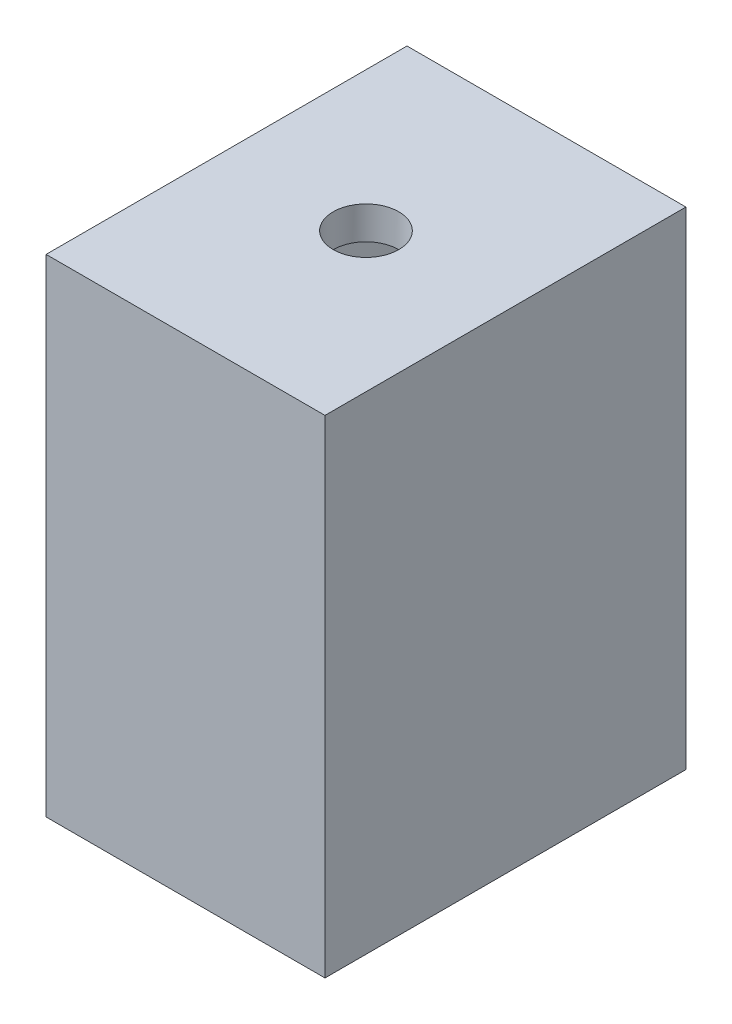
ISO-10303-21;
HEADER;
FILE_DESCRIPTION(('STEP AP214'),'2;1');
FILE_NAME('part.step','',(''),(''),'','','');
FILE_SCHEMA(('AUTOMOTIVE_DESIGN { 1 0 10303 214 1 1 1 1 }'));
ENDSEC;
DATA;
#1=APPLICATION_CONTEXT('core data for automotive mechanical design processes');
#2=APPLICATION_PROTOCOL_DEFINITION('international standard','automotive_design',2000,#1);
#3=PRODUCT_CONTEXT('',#1,'mechanical');
#4=PRODUCT('Part','Part','',(#3));
#5=PRODUCT_RELATED_PRODUCT_CATEGORY('part','',(#4));
#6=PRODUCT_DEFINITION_FORMATION('','',#4);
#7=PRODUCT_DEFINITION_CONTEXT('part definition',#1,'design');
#8=PRODUCT_DEFINITION('design','',#6,#7);
#9=PRODUCT_DEFINITION_SHAPE('','',#8);
#10=(LENGTH_UNIT() NAMED_UNIT(*) SI_UNIT(.MILLI.,.METRE.));
#11=(NAMED_UNIT(*) PLANE_ANGLE_UNIT() SI_UNIT($,.RADIAN.));
#12=(NAMED_UNIT(*) SI_UNIT($,.STERADIAN.) SOLID_ANGLE_UNIT());
#13=UNCERTAINTY_MEASURE_WITH_UNIT(LENGTH_MEASURE(1.E-05),#10,'distance_accuracy_value','');
#14=(GEOMETRIC_REPRESENTATION_CONTEXT(3) GLOBAL_UNCERTAINTY_ASSIGNED_CONTEXT((#13)) GLOBAL_UNIT_ASSIGNED_CONTEXT((#10,
#11,#12)) REPRESENTATION_CONTEXT('',''));
#15=CARTESIAN_POINT('',(0.,0.,0.));
#16=DIRECTION('',(0.,0.,1.));
#17=DIRECTION('',(1.,0.,0.));
#18=AXIS2_PLACEMENT_3D('',#15,#16,#17);
#19=CARTESIAN_POINT('',(8.5,0.,11.));
#20=DIRECTION('',(0.,1.,0.));
#21=DIRECTION('',(0.,0.,1.));
#22=AXIS2_PLACEMENT_3D('',#19,#20,#21);
#23=CYLINDRICAL_SURFACE('',#22,2.);
#24=CARTESIAN_POINT('',(8.5,29.7,11.));
#25=DIRECTION('',(0.,1.,0.));
#26=DIRECTION('',(0.,0.,1.));
#27=AXIS2_PLACEMENT_3D('',#24,#25,#26);
#28=CIRCLE('',#27,2.);
#29=CARTESIAN_POINT('',(8.5,29.7,13.));
#30=VERTEX_POINT('',#29);
#31=EDGE_CURVE('E175',#30,#30,#28,.T.);
#32=ORIENTED_EDGE('',*,*,#31,.T.);
#33=EDGE_LOOP('',(#32));
#34=FACE_BOUND('',#33,.T.);
#35=CARTESIAN_POINT('',(8.5,27.7,11.));
#36=DIRECTION('',(0.,-1.,0.));
#37=DIRECTION('',(0.,0.,-1.));
#38=AXIS2_PLACEMENT_3D('',#35,#36,#37);
#39=CIRCLE('',#38,2.);
#40=CARTESIAN_POINT('',(8.5,27.7,9.));
#41=VERTEX_POINT('',#40);
#42=EDGE_CURVE('E174',#41,#41,#39,.F.);
#43=ORIENTED_EDGE('',*,*,#42,.F.);
#44=EDGE_LOOP('',(#43));
#45=FACE_BOUND('',#44,.T.);
#46=ADVANCED_FACE('F38',(#34,#45),#23,.F.);
#47=CARTESIAN_POINT('',(0.,0.,22.));
#48=DIRECTION('',(1.,0.,0.));
#49=DIRECTION('',(0.,0.,-1.));
#50=AXIS2_PLACEMENT_3D('',#47,#48,#49);
#51=PLANE('',#50);
#52=DIRECTION('',(0.,-1.,0.));
#53=VECTOR('',#52,1.);
#54=CARTESIAN_POINT('',(0.,0.,0.));
#55=LINE('',#54,#53);
#56=CARTESIAN_POINT('',(0.,29.7,0.));
#57=VERTEX_POINT('',#56);
#58=CARTESIAN_POINT('',(0.,0.,0.));
#59=VERTEX_POINT('',#58);
#60=EDGE_CURVE('E179',#57,#59,#55,.T.);
#61=ORIENTED_EDGE('',*,*,#60,.T.);
#62=DIRECTION('',(0.,0.,-1.));
#63=VECTOR('',#62,1.);
#64=CARTESIAN_POINT('',(0.,0.,22.));
#65=LINE('',#64,#63);
#66=CARTESIAN_POINT('',(0.,0.,22.));
#67=VERTEX_POINT('',#66);
#68=EDGE_CURVE('E11',#67,#59,#65,.T.);
#69=ORIENTED_EDGE('',*,*,#68,.F.);
#70=DIRECTION('',(0.,-1.,0.));
#71=VECTOR('',#70,1.);
#72=CARTESIAN_POINT('',(0.,0.,22.));
#73=LINE('',#72,#71);
#74=CARTESIAN_POINT('',(0.,29.7,22.));
#75=VERTEX_POINT('',#74);
#76=EDGE_CURVE('E180',#75,#67,#73,.T.);
#77=ORIENTED_EDGE('',*,*,#76,.F.);
#78=DIRECTION('',(0.,0.,-1.));
#79=VECTOR('',#78,1.);
#80=CARTESIAN_POINT('',(0.,29.7,22.));
#81=LINE('',#80,#79);
#82=EDGE_CURVE('E190',#75,#57,#81,.T.);
#83=ORIENTED_EDGE('',*,*,#82,.T.);
#84=EDGE_LOOP('',(#61,#69,#77,#83));
#85=FACE_BOUND('',#84,.T.);
#86=ADVANCED_FACE('F40',(#85),#51,.F.);
#87=CARTESIAN_POINT('',(0.,0.,22.));
#88=DIRECTION('',(0.,1.,0.));
#89=DIRECTION('',(0.,0.,1.));
#90=AXIS2_PLACEMENT_3D('',#87,#88,#89);
#91=PLANE('',#90);
#92=CARTESIAN_POINT('',(8.5,0.,11.));
#93=DIRECTION('',(0.,-1.,0.));
#94=DIRECTION('',(0.,0.,-1.));
#95=AXIS2_PLACEMENT_3D('',#92,#93,#94);
#96=CIRCLE('',#95,4.);
#97=CARTESIAN_POINT('',(8.5,0.,7.));
#98=VERTEX_POINT('',#97);
#99=EDGE_CURVE('E170',#98,#98,#96,.T.);
#100=ORIENTED_EDGE('',*,*,#99,.F.);
#101=EDGE_LOOP('',(#100));
#102=FACE_BOUND('',#101,.T.);
#103=DIRECTION('',(1.,0.,0.));
#104=VECTOR('',#103,1.);
#105=CARTESIAN_POINT('',(0.,0.,0.));
#106=LINE('',#105,#104);
#107=CARTESIAN_POINT('',(17.,0.,0.));
#108=VERTEX_POINT('',#107);
#109=EDGE_CURVE('E194',#59,#108,#106,.T.);
#110=ORIENTED_EDGE('',*,*,#109,.T.);
#111=DIRECTION('',(0.,0.,-1.));
#112=VECTOR('',#111,1.);
#113=CARTESIAN_POINT('',(17.,0.,22.));
#114=LINE('',#113,#112);
#115=CARTESIAN_POINT('',(17.,0.,22.));
#116=VERTEX_POINT('',#115);
#117=EDGE_CURVE('E49',#116,#108,#114,.T.);
#118=ORIENTED_EDGE('',*,*,#117,.F.);
#119=DIRECTION('',(1.,0.,0.));
#120=VECTOR('',#119,1.);
#121=CARTESIAN_POINT('',(0.,0.,22.));
#122=LINE('',#121,#120);
#123=EDGE_CURVE('E89',#67,#116,#122,.T.);
#124=ORIENTED_EDGE('',*,*,#123,.F.);
#125=ORIENTED_EDGE('',*,*,#68,.T.);
#126=EDGE_LOOP('',(#110,#118,#124,#125));
#127=FACE_BOUND('',#126,.T.);
#128=ADVANCED_FACE('F220',(#102,#127),#91,.F.);
#129=CARTESIAN_POINT('',(17.,0.,22.));
#130=DIRECTION('',(-1.,0.,0.));
#131=DIRECTION('',(0.,0.,1.));
#132=AXIS2_PLACEMENT_3D('',#129,#130,#131);
#133=PLANE('',#132);
#134=DIRECTION('',(0.,1.,0.));
#135=VECTOR('',#134,1.);
#136=CARTESIAN_POINT('',(17.,0.,0.));
#137=LINE('',#136,#135);
#138=CARTESIAN_POINT('',(17.,29.7,0.));
#139=VERTEX_POINT('',#138);
#140=EDGE_CURVE('E76',#108,#139,#137,.T.);
#141=ORIENTED_EDGE('',*,*,#140,.T.);
#142=DIRECTION('',(0.,0.,-1.));
#143=VECTOR('',#142,1.);
#144=CARTESIAN_POINT('',(17.,29.7,22.));
#145=LINE('',#144,#143);
#146=CARTESIAN_POINT('',(17.,29.7,22.));
#147=VERTEX_POINT('',#146);
#148=EDGE_CURVE('E203',#147,#139,#145,.T.);
#149=ORIENTED_EDGE('',*,*,#148,.F.);
#150=DIRECTION('',(0.,1.,0.));
#151=VECTOR('',#150,1.);
#152=CARTESIAN_POINT('',(17.,0.,22.));
#153=LINE('',#152,#151);
#154=EDGE_CURVE('E185',#116,#147,#153,.T.);
#155=ORIENTED_EDGE('',*,*,#154,.F.);
#156=ORIENTED_EDGE('',*,*,#117,.T.);
#157=EDGE_LOOP('',(#141,#149,#155,#156));
#158=FACE_BOUND('',#157,.T.);
#159=ADVANCED_FACE('F236',(#158),#133,.F.);
#160=CARTESIAN_POINT('',(0.,29.7,22.));
#161=DIRECTION('',(0.,-1.,0.));
#162=DIRECTION('',(0.,0.,-1.));
#163=AXIS2_PLACEMENT_3D('',#160,#161,#162);
#164=PLANE('',#163);
#165=ORIENTED_EDGE('',*,*,#31,.F.);
#166=EDGE_LOOP('',(#165));
#167=FACE_BOUND('',#166,.T.);
#168=DIRECTION('',(-1.,0.,0.));
#169=VECTOR('',#168,1.);
#170=CARTESIAN_POINT('',(0.,29.7,0.));
#171=LINE('',#170,#169);
#172=EDGE_CURVE('E82',#139,#57,#171,.T.);
#173=ORIENTED_EDGE('',*,*,#172,.T.);
#174=ORIENTED_EDGE('',*,*,#82,.F.);
#175=DIRECTION('',(-1.,0.,0.));
#176=VECTOR('',#175,1.);
#177=CARTESIAN_POINT('',(0.,29.7,22.));
#178=LINE('',#177,#176);
#179=EDGE_CURVE('E58',#147,#75,#178,.T.);
#180=ORIENTED_EDGE('',*,*,#179,.F.);
#181=ORIENTED_EDGE('',*,*,#148,.T.);
#182=EDGE_LOOP('',(#173,#174,#180,#181));
#183=FACE_BOUND('',#182,.T.);
#184=ADVANCED_FACE('F230',(#167,#183),#164,.F.);
#185=CARTESIAN_POINT('',(0.,0.,22.));
#186=DIRECTION('',(0.,0.,-1.));
#187=DIRECTION('',(-1.,0.,0.));
#188=AXIS2_PLACEMENT_3D('',#185,#186,#187);
#189=PLANE('',#188);
#190=ORIENTED_EDGE('',*,*,#76,.T.);
#191=ORIENTED_EDGE('',*,*,#123,.T.);
#192=ORIENTED_EDGE('',*,*,#154,.T.);
#193=ORIENTED_EDGE('',*,*,#179,.T.);
#194=EDGE_LOOP('',(#190,#191,#192,#193));
#195=FACE_BOUND('',#194,.T.);
#196=ADVANCED_FACE('F226',(#195),#189,.F.);
#197=CARTESIAN_POINT('',(0.,0.,0.));
#198=DIRECTION('',(0.,0.,-1.));
#199=DIRECTION('',(-1.,0.,0.));
#200=AXIS2_PLACEMENT_3D('',#197,#198,#199);
#201=PLANE('',#200);
#202=ORIENTED_EDGE('',*,*,#60,.F.);
#203=ORIENTED_EDGE('',*,*,#172,.F.);
#204=ORIENTED_EDGE('',*,*,#140,.F.);
#205=ORIENTED_EDGE('',*,*,#109,.F.);
#206=EDGE_LOOP('',(#202,#203,#204,#205));
#207=FACE_BOUND('',#206,.T.);
#208=ADVANCED_FACE('F229',(#207),#201,.T.);
#209=CARTESIAN_POINT('',(8.5,27.7,11.));
#210=DIRECTION('',(0.,-1.,0.));
#211=DIRECTION('',(0.,0.,-1.));
#212=AXIS2_PLACEMENT_3D('',#209,#210,#211);
#213=PLANE('',#212);
#214=ORIENTED_EDGE('',*,*,#42,.T.);
#215=EDGE_LOOP('',(#214));
#216=FACE_BOUND('',#215,.T.);
#217=DIRECTION('',(1.,0.,0.));
#218=VECTOR('',#217,1.);
#219=CARTESIAN_POINT('',(2.,27.7,2.));
#220=LINE('',#219,#218);
#221=CARTESIAN_POINT('',(2.,27.7,2.));
#222=VERTEX_POINT('',#221);
#223=CARTESIAN_POINT('',(15.,27.7,2.));
#224=VERTEX_POINT('',#223);
#225=EDGE_CURVE('E120',#222,#224,#220,.T.);
#226=ORIENTED_EDGE('',*,*,#225,.T.);
#227=DIRECTION('',(0.,0.,1.));
#228=VECTOR('',#227,1.);
#229=CARTESIAN_POINT('',(15.,27.7,2.));
#230=LINE('',#229,#228);
#231=CARTESIAN_POINT('',(15.,27.7,20.));
#232=VERTEX_POINT('',#231);
#233=EDGE_CURVE('E132',#224,#232,#230,.T.);
#234=ORIENTED_EDGE('',*,*,#233,.T.);
#235=DIRECTION('',(-1.,0.,0.));
#236=VECTOR('',#235,1.);
#237=CARTESIAN_POINT('',(15.,27.7,20.));
#238=LINE('',#237,#236);
#239=CARTESIAN_POINT('',(2.,27.7,20.));
#240=VERTEX_POINT('',#239);
#241=EDGE_CURVE('E138',#232,#240,#238,.T.);
#242=ORIENTED_EDGE('',*,*,#241,.T.);
#243=DIRECTION('',(0.,0.,-1.));
#244=VECTOR('',#243,1.);
#245=CARTESIAN_POINT('',(2.,27.7,20.));
#246=LINE('',#245,#244);
#247=EDGE_CURVE('E129',#240,#222,#246,.T.);
#248=ORIENTED_EDGE('',*,*,#247,.T.);
#249=EDGE_LOOP('',(#226,#234,#242,#248));
#250=FACE_BOUND('',#249,.T.);
#251=ADVANCED_FACE('F140',(#216,#250),#213,.T.);
#252=CARTESIAN_POINT('',(8.5,27.7,11.));
#253=DIRECTION('',(0.,-1.,0.));
#254=DIRECTION('',(0.,0.,-1.));
#255=AXIS2_PLACEMENT_3D('',#252,#253,#254);
#256=CYLINDRICAL_SURFACE('',#255,4.);
#257=CARTESIAN_POINT('',(8.5,2.,11.));
#258=DIRECTION('',(0.,-1.,0.));
#259=DIRECTION('',(0.,0.,-1.));
#260=AXIS2_PLACEMENT_3D('',#257,#258,#259);
#261=CIRCLE('',#260,4.);
#262=CARTESIAN_POINT('',(8.5,2.,7.));
#263=VERTEX_POINT('',#262);
#264=EDGE_CURVE('E42',#263,#263,#261,.F.);
#265=ORIENTED_EDGE('',*,*,#264,.T.);
#266=EDGE_LOOP('',(#265));
#267=FACE_BOUND('',#266,.T.);
#268=ORIENTED_EDGE('',*,*,#99,.T.);
#269=EDGE_LOOP('',(#268));
#270=FACE_BOUND('',#269,.T.);
#271=ADVANCED_FACE('F224',(#267,#270),#256,.F.);
#272=CARTESIAN_POINT('',(0.,2.,0.));
#273=DIRECTION('',(0.,-1.,0.));
#274=DIRECTION('',(0.,0.,-1.));
#275=AXIS2_PLACEMENT_3D('',#272,#273,#274);
#276=PLANE('',#275);
#277=DIRECTION('',(1.,0.,0.));
#278=VECTOR('',#277,1.);
#279=CARTESIAN_POINT('',(2.,2.,2.));
#280=LINE('',#279,#278);
#281=CARTESIAN_POINT('',(2.,2.,2.));
#282=VERTEX_POINT('',#281);
#283=CARTESIAN_POINT('',(15.,2.,2.));
#284=VERTEX_POINT('',#283);
#285=EDGE_CURVE('E123',#282,#284,#280,.T.);
#286=ORIENTED_EDGE('',*,*,#285,.F.);
#287=DIRECTION('',(0.,0.,-1.));
#288=VECTOR('',#287,1.);
#289=CARTESIAN_POINT('',(2.,2.,20.));
#290=LINE('',#289,#288);
#291=CARTESIAN_POINT('',(2.,2.,20.));
#292=VERTEX_POINT('',#291);
#293=EDGE_CURVE('E143',#292,#282,#290,.T.);
#294=ORIENTED_EDGE('',*,*,#293,.F.);
#295=DIRECTION('',(-1.,0.,0.));
#296=VECTOR('',#295,1.);
#297=CARTESIAN_POINT('',(15.,2.,20.));
#298=LINE('',#297,#296);
#299=CARTESIAN_POINT('',(15.,2.,20.));
#300=VERTEX_POINT('',#299);
#301=EDGE_CURVE('E147',#300,#292,#298,.T.);
#302=ORIENTED_EDGE('',*,*,#301,.F.);
#303=DIRECTION('',(0.,0.,1.));
#304=VECTOR('',#303,1.);
#305=CARTESIAN_POINT('',(15.,2.,2.));
#306=LINE('',#305,#304);
#307=EDGE_CURVE('E156',#284,#300,#306,.T.);
#308=ORIENTED_EDGE('',*,*,#307,.F.);
#309=EDGE_LOOP('',(#286,#294,#302,#308));
#310=FACE_BOUND('',#309,.T.);
#311=ORIENTED_EDGE('',*,*,#264,.F.);
#312=EDGE_LOOP('',(#311));
#313=FACE_BOUND('',#312,.T.);
#314=ADVANCED_FACE('F250',(#310,#313),#276,.F.);
#315=CARTESIAN_POINT('',(2.,27.7,2.));
#316=DIRECTION('',(0.,0.,-1.));
#317=DIRECTION('',(-1.,0.,0.));
#318=AXIS2_PLACEMENT_3D('',#315,#316,#317);
#319=PLANE('',#318);
#320=ORIENTED_EDGE('',*,*,#285,.T.);
#321=DIRECTION('',(0.,-1.,0.));
#322=VECTOR('',#321,1.);
#323=CARTESIAN_POINT('',(15.,27.7,2.));
#324=LINE('',#323,#322);
#325=EDGE_CURVE('E116',#224,#284,#324,.T.);
#326=ORIENTED_EDGE('',*,*,#325,.F.);
#327=ORIENTED_EDGE('',*,*,#225,.F.);
#328=DIRECTION('',(0.,-1.,0.));
#329=VECTOR('',#328,1.);
#330=CARTESIAN_POINT('',(2.,27.7,2.));
#331=LINE('',#330,#329);
#332=EDGE_CURVE('E162',#222,#282,#331,.T.);
#333=ORIENTED_EDGE('',*,*,#332,.T.);
#334=EDGE_LOOP('',(#320,#326,#327,#333));
#335=FACE_BOUND('',#334,.T.);
#336=ADVANCED_FACE('F118',(#335),#319,.F.);
#337=CARTESIAN_POINT('',(2.,27.7,20.));
#338=DIRECTION('',(-1.,0.,0.));
#339=DIRECTION('',(0.,0.,1.));
#340=AXIS2_PLACEMENT_3D('',#337,#338,#339);
#341=PLANE('',#340);
#342=ORIENTED_EDGE('',*,*,#293,.T.);
#343=ORIENTED_EDGE('',*,*,#332,.F.);
#344=ORIENTED_EDGE('',*,*,#247,.F.);
#345=DIRECTION('',(0.,-1.,0.));
#346=VECTOR('',#345,1.);
#347=CARTESIAN_POINT('',(2.,27.7,20.));
#348=LINE('',#347,#346);
#349=EDGE_CURVE('E165',#240,#292,#348,.T.);
#350=ORIENTED_EDGE('',*,*,#349,.T.);
#351=EDGE_LOOP('',(#342,#343,#344,#350));
#352=FACE_BOUND('',#351,.T.);
#353=ADVANCED_FACE('F267',(#352),#341,.F.);
#354=CARTESIAN_POINT('',(15.,27.7,20.));
#355=DIRECTION('',(0.,0.,1.));
#356=DIRECTION('',(1.,0.,0.));
#357=AXIS2_PLACEMENT_3D('',#354,#355,#356);
#358=PLANE('',#357);
#359=ORIENTED_EDGE('',*,*,#301,.T.);
#360=ORIENTED_EDGE('',*,*,#349,.F.);
#361=ORIENTED_EDGE('',*,*,#241,.F.);
#362=DIRECTION('',(0.,-1.,0.));
#363=VECTOR('',#362,1.);
#364=CARTESIAN_POINT('',(15.,27.7,20.));
#365=LINE('',#364,#363);
#366=EDGE_CURVE('E128',#232,#300,#365,.T.);
#367=ORIENTED_EDGE('',*,*,#366,.T.);
#368=EDGE_LOOP('',(#359,#360,#361,#367));
#369=FACE_BOUND('',#368,.T.);
#370=ADVANCED_FACE('F270',(#369),#358,.F.);
#371=CARTESIAN_POINT('',(15.,27.7,2.));
#372=DIRECTION('',(1.,0.,0.));
#373=DIRECTION('',(0.,0.,-1.));
#374=AXIS2_PLACEMENT_3D('',#371,#372,#373);
#375=PLANE('',#374);
#376=ORIENTED_EDGE('',*,*,#307,.T.);
#377=ORIENTED_EDGE('',*,*,#366,.F.);
#378=ORIENTED_EDGE('',*,*,#233,.F.);
#379=ORIENTED_EDGE('',*,*,#325,.T.);
#380=EDGE_LOOP('',(#376,#377,#378,#379));
#381=FACE_BOUND('',#380,.T.);
#382=ADVANCED_FACE('F133',(#381),#375,.F.);
#383=CLOSED_SHELL('',(#46,#86,#128,#159,#184,#196,#208,#251,#271,#314,#336,#353,#370,#382));
#384=MANIFOLD_SOLID_BREP('B2',#383);
#385=ADVANCED_BREP_SHAPE_REPRESENTATION('',(#18,#384),#14);
#386=SHAPE_DEFINITION_REPRESENTATION(#9,#385);
ENDSEC;
END-ISO-10303-21;
